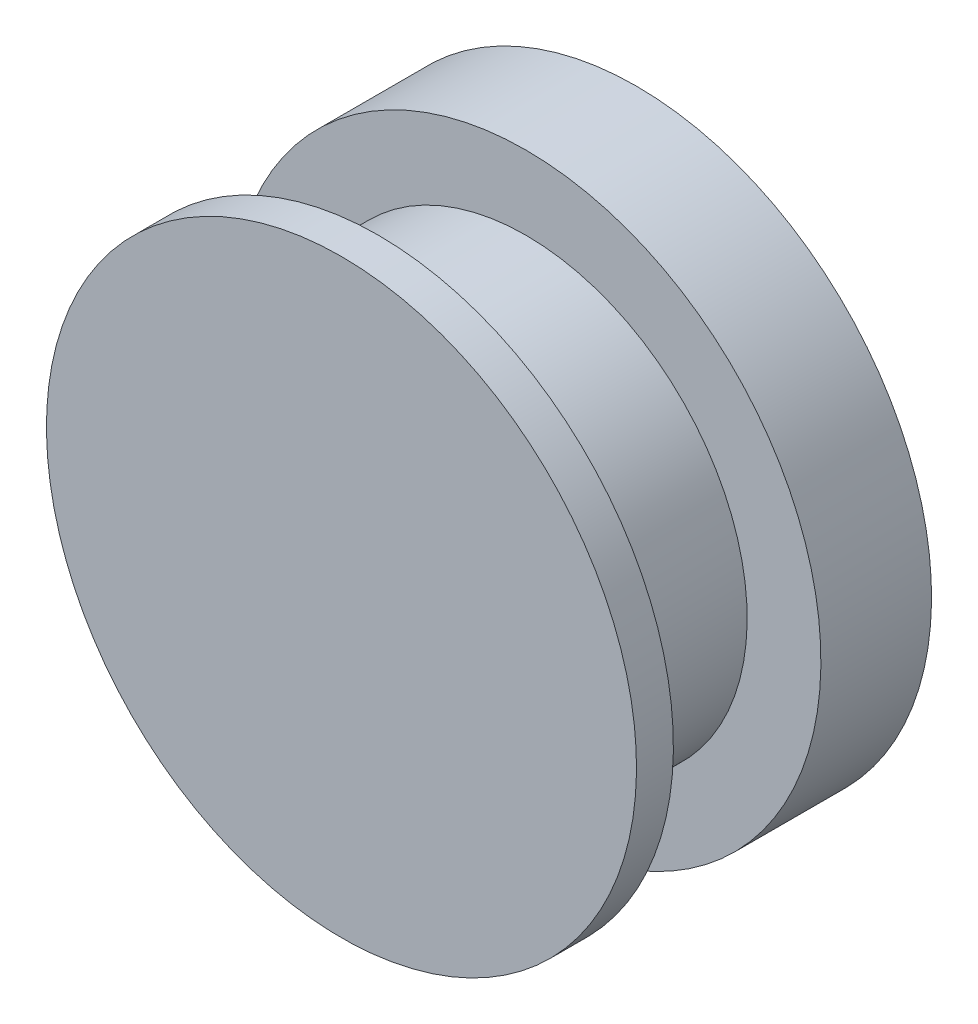
ISO-10303-21;
HEADER;
FILE_DESCRIPTION(('STEP AP214'),'2;1');
FILE_NAME('part.step','',(''),(''),'','','');
FILE_SCHEMA(('AUTOMOTIVE_DESIGN { 1 0 10303 214 1 1 1 1 }'));
ENDSEC;
DATA;
#1=APPLICATION_CONTEXT('core data for automotive mechanical design processes');
#2=APPLICATION_PROTOCOL_DEFINITION('international standard','automotive_design',2000,#1);
#3=PRODUCT_CONTEXT('',#1,'mechanical');
#4=PRODUCT('Part','Part','',(#3));
#5=PRODUCT_RELATED_PRODUCT_CATEGORY('part','',(#4));
#6=PRODUCT_DEFINITION_FORMATION('','',#4);
#7=PRODUCT_DEFINITION_CONTEXT('part definition',#1,'design');
#8=PRODUCT_DEFINITION('design','',#6,#7);
#9=PRODUCT_DEFINITION_SHAPE('','',#8);
#10=(LENGTH_UNIT() NAMED_UNIT(*) SI_UNIT(.MILLI.,.METRE.));
#11=(NAMED_UNIT(*) PLANE_ANGLE_UNIT() SI_UNIT($,.RADIAN.));
#12=(NAMED_UNIT(*) SI_UNIT($,.STERADIAN.) SOLID_ANGLE_UNIT());
#13=UNCERTAINTY_MEASURE_WITH_UNIT(LENGTH_MEASURE(1.E-05),#10,'distance_accuracy_value','');
#14=(GEOMETRIC_REPRESENTATION_CONTEXT(3) GLOBAL_UNCERTAINTY_ASSIGNED_CONTEXT((#13)) GLOBAL_UNIT_ASSIGNED_CONTEXT((#10,
#11,#12)) REPRESENTATION_CONTEXT('',''));
#15=CARTESIAN_POINT('',(0.,0.,0.));
#16=DIRECTION('',(0.,0.,1.));
#17=DIRECTION('',(1.,0.,0.));
#18=AXIS2_PLACEMENT_3D('',#15,#16,#17);
#19=CARTESIAN_POINT('',(0.,0.,0.));
#20=DIRECTION('',(0.,0.,1.));
#21=DIRECTION('',(0.,-1.,0.));
#22=AXIS2_PLACEMENT_3D('',#19,#20,#21);
#23=PLANE('',#22);
#24=CARTESIAN_POINT('',(0.,0.,0.));
#25=DIRECTION('',(0.,0.,-1.));
#26=DIRECTION('',(0.,1.,0.));
#27=AXIS2_PLACEMENT_3D('',#24,#25,#26);
#28=CIRCLE('',#27,2.032);
#29=CARTESIAN_POINT('',(0.,2.032,0.));
#30=VERTEX_POINT('',#29);
#31=EDGE_CURVE('E10',#30,#30,#28,.T.);
#32=ORIENTED_EDGE('',*,*,#31,.F.);
#33=EDGE_LOOP('',(#32));
#34=FACE_BOUND('',#33,.T.);
#35=ADVANCED_FACE('F35',(#34),#23,.T.);
#36=CARTESIAN_POINT('',(0.,0.,-2.032));
#37=DIRECTION('',(0.,0.,-1.));
#38=DIRECTION('',(0.,1.,0.));
#39=AXIS2_PLACEMENT_3D('',#36,#37,#38);
#40=CYLINDRICAL_SURFACE('',#39,2.032);
#41=ORIENTED_EDGE('',*,*,#31,.T.);
#42=EDGE_LOOP('',(#41));
#43=FACE_BOUND('',#42,.T.);
#44=CARTESIAN_POINT('',(0.,0.,-0.254));
#45=DIRECTION('',(0.,0.,-1.));
#46=DIRECTION('',(0.,1.,0.));
#47=AXIS2_PLACEMENT_3D('',#44,#45,#46);
#48=CIRCLE('',#47,2.032);
#49=CARTESIAN_POINT('',(0.,2.032,-0.254));
#50=VERTEX_POINT('',#49);
#51=EDGE_CURVE('E41',#50,#50,#48,.T.);
#52=ORIENTED_EDGE('',*,*,#51,.F.);
#53=EDGE_LOOP('',(#52));
#54=FACE_BOUND('',#53,.T.);
#55=ADVANCED_FACE('F77',(#43,#54),#40,.T.);
#56=CARTESIAN_POINT('',(0.,2.032,-0.254));
#57=DIRECTION('',(0.,0.,-1.));
#58=DIRECTION('',(0.,1.,0.));
#59=AXIS2_PLACEMENT_3D('',#56,#57,#58);
#60=PLANE('',#59);
#61=ORIENTED_EDGE('',*,*,#51,.T.);
#62=EDGE_LOOP('',(#61));
#63=FACE_BOUND('',#62,.T.);
#64=CARTESIAN_POINT('',(0.,0.,-0.254));
#65=DIRECTION('',(0.,0.,-1.));
#66=DIRECTION('',(0.,1.,0.));
#67=AXIS2_PLACEMENT_3D('',#64,#65,#66);
#68=CIRCLE('',#67,1.524);
#69=CARTESIAN_POINT('',(0.,1.524,-0.254));
#70=VERTEX_POINT('',#69);
#71=EDGE_CURVE('E45',#70,#70,#68,.T.);
#72=ORIENTED_EDGE('',*,*,#71,.F.);
#73=EDGE_LOOP('',(#72));
#74=FACE_BOUND('',#73,.T.);
#75=ADVANCED_FACE('F82',(#63,#74),#60,.T.);
#76=CARTESIAN_POINT('',(0.,0.,-2.032));
#77=DIRECTION('',(0.,0.,-1.));
#78=DIRECTION('',(0.,1.,0.));
#79=AXIS2_PLACEMENT_3D('',#76,#77,#78);
#80=CYLINDRICAL_SURFACE('',#79,1.524);
#81=ORIENTED_EDGE('',*,*,#71,.T.);
#82=EDGE_LOOP('',(#81));
#83=FACE_BOUND('',#82,.T.);
#84=CARTESIAN_POINT('',(0.,0.,-1.27));
#85=DIRECTION('',(0.,0.,-1.));
#86=DIRECTION('',(0.,1.,0.));
#87=AXIS2_PLACEMENT_3D('',#84,#85,#86);
#88=CIRCLE('',#87,1.524);
#89=CARTESIAN_POINT('',(0.,1.524,-1.27));
#90=VERTEX_POINT('',#89);
#91=EDGE_CURVE('E49',#90,#90,#88,.T.);
#92=ORIENTED_EDGE('',*,*,#91,.F.);
#93=EDGE_LOOP('',(#92));
#94=FACE_BOUND('',#93,.T.);
#95=ADVANCED_FACE('F73',(#83,#94),#80,.T.);
#96=CARTESIAN_POINT('',(0.,1.524,-1.27));
#97=DIRECTION('',(0.,0.,1.));
#98=DIRECTION('',(0.,-1.,0.));
#99=AXIS2_PLACEMENT_3D('',#96,#97,#98);
#100=PLANE('',#99);
#101=ORIENTED_EDGE('',*,*,#91,.T.);
#102=EDGE_LOOP('',(#101));
#103=FACE_BOUND('',#102,.T.);
#104=CARTESIAN_POINT('',(0.,0.,-1.27));
#105=DIRECTION('',(0.,0.,-1.));
#106=DIRECTION('',(0.,1.,0.));
#107=AXIS2_PLACEMENT_3D('',#104,#105,#106);
#108=CIRCLE('',#107,2.032);
#109=CARTESIAN_POINT('',(0.,2.032,-1.27));
#110=VERTEX_POINT('',#109);
#111=EDGE_CURVE('E54',#110,#110,#108,.T.);
#112=ORIENTED_EDGE('',*,*,#111,.F.);
#113=EDGE_LOOP('',(#112));
#114=FACE_BOUND('',#113,.T.);
#115=ADVANCED_FACE('F65',(#103,#114),#100,.T.);
#116=CARTESIAN_POINT('',(0.,0.,-2.032));
#117=DIRECTION('',(0.,0.,-1.));
#118=DIRECTION('',(0.,1.,0.));
#119=AXIS2_PLACEMENT_3D('',#116,#117,#118);
#120=CYLINDRICAL_SURFACE('',#119,2.032);
#121=ORIENTED_EDGE('',*,*,#111,.T.);
#122=EDGE_LOOP('',(#121));
#123=FACE_BOUND('',#122,.T.);
#124=CARTESIAN_POINT('',(0.,0.,-2.032));
#125=DIRECTION('',(0.,0.,-1.));
#126=DIRECTION('',(0.,1.,0.));
#127=AXIS2_PLACEMENT_3D('',#124,#125,#126);
#128=CIRCLE('',#127,2.032);
#129=CARTESIAN_POINT('',(0.,2.032,-2.032));
#130=VERTEX_POINT('',#129);
#131=EDGE_CURVE('E57',#130,#130,#128,.T.);
#132=ORIENTED_EDGE('',*,*,#131,.F.);
#133=EDGE_LOOP('',(#132));
#134=FACE_BOUND('',#133,.T.);
#135=ADVANCED_FACE('F63',(#123,#134),#120,.T.);
#136=CARTESIAN_POINT('',(0.,2.032,-2.032));
#137=DIRECTION('',(0.,0.,-1.));
#138=DIRECTION('',(0.,1.,0.));
#139=AXIS2_PLACEMENT_3D('',#136,#137,#138);
#140=PLANE('',#139);
#141=ORIENTED_EDGE('',*,*,#131,.T.);
#142=EDGE_LOOP('',(#141));
#143=FACE_BOUND('',#142,.T.);
#144=ADVANCED_FACE('F61',(#143),#140,.T.);
#145=CLOSED_SHELL('',(#35,#55,#75,#95,#115,#135,#144));
#146=MANIFOLD_SOLID_BREP('B2',#145);
#147=ADVANCED_BREP_SHAPE_REPRESENTATION('',(#18,#146),#14);
#148=SHAPE_DEFINITION_REPRESENTATION(#9,#147);
ENDSEC;
END-ISO-10303-21;
